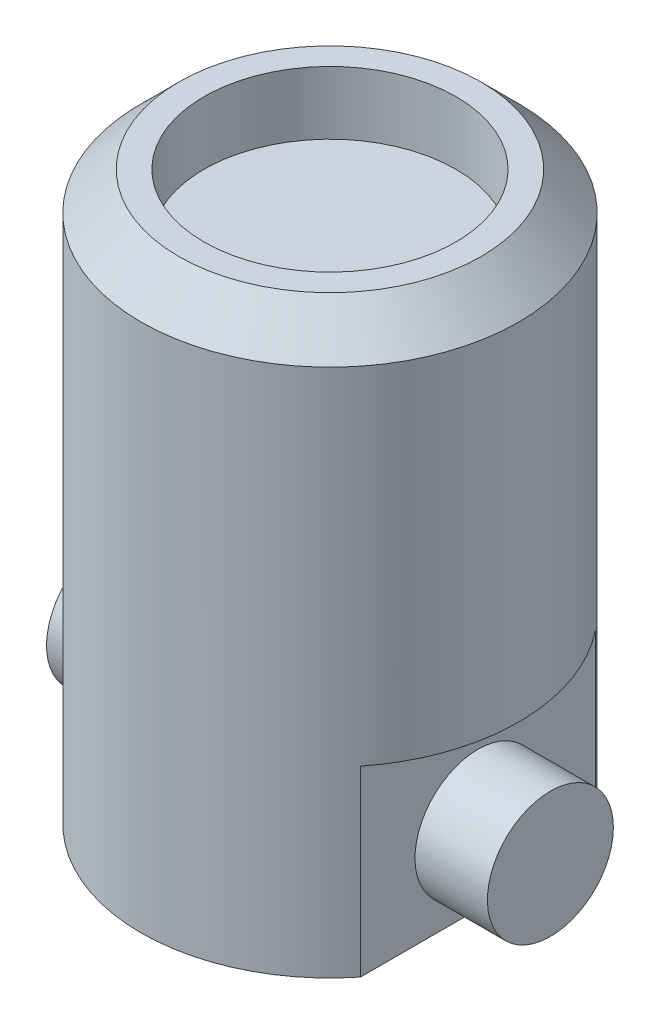
ISO-10303-21;
HEADER;
FILE_DESCRIPTION(('STEP AP214'),'2;1');
FILE_NAME('part.step','',(''),(''),'','','');
FILE_SCHEMA(('AUTOMOTIVE_DESIGN { 1 0 10303 214 1 1 1 1 }'));
ENDSEC;
DATA;
#1=APPLICATION_CONTEXT('core data for automotive mechanical design processes');
#2=APPLICATION_PROTOCOL_DEFINITION('international standard','automotive_design',2000,#1);
#3=PRODUCT_CONTEXT('',#1,'mechanical');
#4=PRODUCT('Part','Part','',(#3));
#5=PRODUCT_RELATED_PRODUCT_CATEGORY('part','',(#4));
#6=PRODUCT_DEFINITION_FORMATION('','',#4);
#7=PRODUCT_DEFINITION_CONTEXT('part definition',#1,'design');
#8=PRODUCT_DEFINITION('design','',#6,#7);
#9=PRODUCT_DEFINITION_SHAPE('','',#8);
#10=(LENGTH_UNIT() NAMED_UNIT(*) SI_UNIT(.MILLI.,.METRE.));
#11=(NAMED_UNIT(*) PLANE_ANGLE_UNIT() SI_UNIT($,.RADIAN.));
#12=(NAMED_UNIT(*) SI_UNIT($,.STERADIAN.) SOLID_ANGLE_UNIT());
#13=UNCERTAINTY_MEASURE_WITH_UNIT(LENGTH_MEASURE(1.E-05),#10,'distance_accuracy_value','');
#14=(GEOMETRIC_REPRESENTATION_CONTEXT(3) GLOBAL_UNCERTAINTY_ASSIGNED_CONTEXT((#13)) GLOBAL_UNIT_ASSIGNED_CONTEXT((#10,
#11,#12)) REPRESENTATION_CONTEXT('',''));
#15=CARTESIAN_POINT('',(0.,0.,0.));
#16=DIRECTION('',(0.,0.,1.));
#17=DIRECTION('',(1.,0.,0.));
#18=AXIS2_PLACEMENT_3D('',#15,#16,#17);
#19=CARTESIAN_POINT('',(-23.5,-37.4758211309043,-20.));
#20=DIRECTION('',(-1.,0.,0.));
#21=DIRECTION('',(0.,-1.,0.));
#22=AXIS2_PLACEMENT_3D('',#19,#20,#21);
#23=PLANE('',#22);
#24=DIRECTION('',(0.,-1.,0.));
#25=VECTOR('',#24,1.);
#26=CARTESIAN_POINT('',(-23.5,90.,-18.6480561989715));
#27=LINE('',#26,#25);
#28=CARTESIAN_POINT('',(-23.5,29.0000000000001,-18.6480561989715));
#29=VERTEX_POINT('',#28);
#30=CARTESIAN_POINT('',(-23.5,0.,-18.6480561989715));
#31=VERTEX_POINT('',#30);
#32=EDGE_CURVE('E120',#29,#31,#27,.T.);
#33=ORIENTED_EDGE('',*,*,#32,.T.);
#34=DIRECTION('',(0.,0.,1.));
#35=VECTOR('',#34,1.);
#36=CARTESIAN_POINT('',(-23.5,0.,0.));
#37=LINE('',#36,#35);
#38=CARTESIAN_POINT('',(-23.5,0.,18.6480561989715));
#39=VERTEX_POINT('',#38);
#40=EDGE_CURVE('E124',#31,#39,#37,.T.);
#41=ORIENTED_EDGE('',*,*,#40,.T.);
#42=DIRECTION('',(0.,-1.,0.));
#43=VECTOR('',#42,1.);
#44=CARTESIAN_POINT('',(-23.5,90.,18.6480561989715));
#45=LINE('',#44,#43);
#46=CARTESIAN_POINT('',(-23.5,29.0000000000001,18.6480561989715));
#47=VERTEX_POINT('',#46);
#48=EDGE_CURVE('E118',#39,#47,#45,.F.);
#49=ORIENTED_EDGE('',*,*,#48,.T.);
#50=DIRECTION('',(0.,0.,1.));
#51=VECTOR('',#50,1.);
#52=CARTESIAN_POINT('',(-23.5,29.0000000000001,-20.));
#53=LINE('',#52,#51);
#54=EDGE_CURVE('E115',#29,#47,#53,.T.);
#55=ORIENTED_EDGE('',*,*,#54,.F.);
#56=EDGE_LOOP('',(#33,#41,#49,#55));
#57=FACE_BOUND('',#56,.T.);
#58=CARTESIAN_POINT('',(-23.5,12.,0.));
#59=DIRECTION('',(-1.,0.,0.));
#60=DIRECTION('',(0.,-1.,0.));
#61=AXIS2_PLACEMENT_3D('',#58,#59,#60);
#62=CIRCLE('',#61,10.);
#63=CARTESIAN_POINT('',(-23.5,2.,0.));
#64=VERTEX_POINT('',#63);
#65=EDGE_CURVE('E86',#64,#64,#62,.F.);
#66=ORIENTED_EDGE('',*,*,#65,.T.);
#67=EDGE_LOOP('',(#66));
#68=FACE_BOUND('',#67,.T.);
#69=ADVANCED_FACE('F34',(#57,#68),#23,.T.);
#70=CARTESIAN_POINT('',(23.5,-37.4758211309043,-20.));
#71=DIRECTION('',(1.,0.,0.));
#72=DIRECTION('',(0.,1.,0.));
#73=AXIS2_PLACEMENT_3D('',#70,#71,#72);
#74=PLANE('',#73);
#75=DIRECTION('',(0.,-1.,0.));
#76=VECTOR('',#75,1.);
#77=CARTESIAN_POINT('',(23.5,90.,18.6480561989715));
#78=LINE('',#77,#76);
#79=CARTESIAN_POINT('',(23.5,29.0000000000001,18.6480561989715));
#80=VERTEX_POINT('',#79);
#81=CARTESIAN_POINT('',(23.5,0.,18.6480561989715));
#82=VERTEX_POINT('',#81);
#83=EDGE_CURVE('E49',#80,#82,#78,.T.);
#84=ORIENTED_EDGE('',*,*,#83,.T.);
#85=DIRECTION('',(0.,0.,-1.));
#86=VECTOR('',#85,1.);
#87=CARTESIAN_POINT('',(23.5,0.,0.));
#88=LINE('',#87,#86);
#89=CARTESIAN_POINT('',(23.5,0.,-18.6480561989715));
#90=VERTEX_POINT('',#89);
#91=EDGE_CURVE('E80',#82,#90,#88,.T.);
#92=ORIENTED_EDGE('',*,*,#91,.T.);
#93=DIRECTION('',(0.,-1.,0.));
#94=VECTOR('',#93,1.);
#95=CARTESIAN_POINT('',(23.5,90.,-18.6480561989715));
#96=LINE('',#95,#94);
#97=CARTESIAN_POINT('',(23.5,29.0000000000001,-18.6480561989715));
#98=VERTEX_POINT('',#97);
#99=EDGE_CURVE('E75',#90,#98,#96,.F.);
#100=ORIENTED_EDGE('',*,*,#99,.T.);
#101=DIRECTION('',(0.,0.,1.));
#102=VECTOR('',#101,1.);
#103=CARTESIAN_POINT('',(23.5,29.0000000000001,-20.));
#104=LINE('',#103,#102);
#105=EDGE_CURVE('E79',#98,#80,#104,.T.);
#106=ORIENTED_EDGE('',*,*,#105,.T.);
#107=EDGE_LOOP('',(#84,#92,#100,#106));
#108=FACE_BOUND('',#107,.T.);
#109=CARTESIAN_POINT('',(23.5,12.,0.));
#110=DIRECTION('',(1.,0.,0.));
#111=DIRECTION('',(0.,1.,0.));
#112=AXIS2_PLACEMENT_3D('',#109,#110,#111);
#113=CIRCLE('',#112,10.);
#114=CARTESIAN_POINT('',(23.5,22.,0.));
#115=VERTEX_POINT('',#114);
#116=EDGE_CURVE('E96',#115,#115,#113,.F.);
#117=ORIENTED_EDGE('',*,*,#116,.T.);
#118=EDGE_LOOP('',(#117));
#119=FACE_BOUND('',#118,.T.);
#120=ADVANCED_FACE('F77',(#108,#119),#74,.T.);
#121=CARTESIAN_POINT('',(0.,90.,0.));
#122=DIRECTION('',(0.,-1.,0.));
#123=DIRECTION('',(0.,0.,-1.));
#124=AXIS2_PLACEMENT_3D('',#121,#122,#123);
#125=CYLINDRICAL_SURFACE('',#124,30.);
#126=CARTESIAN_POINT('',(0.,84.,0.));
#127=DIRECTION('',(0.,1.,0.));
#128=DIRECTION('',(0.,0.,1.));
#129=AXIS2_PLACEMENT_3D('',#126,#127,#128);
#130=CIRCLE('',#129,30.);
#131=CARTESIAN_POINT('',(0.,84.,30.));
#132=VERTEX_POINT('',#131);
#133=EDGE_CURVE('E11',#132,#132,#130,.F.);
#134=ORIENTED_EDGE('',*,*,#133,.T.);
#135=EDGE_LOOP('',(#134));
#136=FACE_BOUND('',#135,.T.);
#137=ORIENTED_EDGE('',*,*,#83,.F.);
#138=CARTESIAN_POINT('',(0.,29.0000000000001,0.));
#139=DIRECTION('',(0.,-1.,0.));
#140=DIRECTION('',(1.,0.,0.));
#141=AXIS2_PLACEMENT_3D('',#138,#139,#140);
#142=CIRCLE('',#141,30.);
#143=EDGE_CURVE('E85',#98,#80,#142,.T.);
#144=ORIENTED_EDGE('',*,*,#143,.F.);
#145=ORIENTED_EDGE('',*,*,#99,.F.);
#146=CARTESIAN_POINT('',(0.,0.,0.));
#147=DIRECTION('',(0.,1.,0.));
#148=DIRECTION('',(0.,0.,1.));
#149=AXIS2_PLACEMENT_3D('',#146,#147,#148);
#150=CIRCLE('',#149,30.);
#151=EDGE_CURVE('E57',#90,#31,#150,.T.);
#152=ORIENTED_EDGE('',*,*,#151,.T.);
#153=ORIENTED_EDGE('',*,*,#32,.F.);
#154=CARTESIAN_POINT('',(0.,29.0000000000001,0.));
#155=DIRECTION('',(0.,-1.,0.));
#156=DIRECTION('',(0.,0.,-1.));
#157=AXIS2_PLACEMENT_3D('',#154,#155,#156);
#158=CIRCLE('',#157,30.);
#159=EDGE_CURVE('E92',#47,#29,#158,.T.);
#160=ORIENTED_EDGE('',*,*,#159,.F.);
#161=ORIENTED_EDGE('',*,*,#48,.F.);
#162=EDGE_CURVE('E122',#39,#82,#150,.T.);
#163=ORIENTED_EDGE('',*,*,#162,.T.);
#164=EDGE_LOOP('',(#137,#144,#145,#152,#153,#160,#161,#163));
#165=FACE_BOUND('',#164,.T.);
#166=ADVANCED_FACE('F88',(#136,#165),#125,.T.);
#167=CARTESIAN_POINT('',(0.,0.,0.));
#168=DIRECTION('',(0.,1.,0.));
#169=DIRECTION('',(0.,0.,1.));
#170=AXIS2_PLACEMENT_3D('',#167,#168,#169);
#171=PLANE('',#170);
#172=ORIENTED_EDGE('',*,*,#91,.F.);
#173=ORIENTED_EDGE('',*,*,#162,.F.);
#174=ORIENTED_EDGE('',*,*,#40,.F.);
#175=ORIENTED_EDGE('',*,*,#151,.F.);
#176=EDGE_LOOP('',(#172,#173,#174,#175));
#177=FACE_BOUND('',#176,.T.);
#178=ADVANCED_FACE('F135',(#177),#171,.F.);
#179=CARTESIAN_POINT('',(0.,90.,0.));
#180=DIRECTION('',(0.,1.,0.));
#181=DIRECTION('',(0.,0.,1.));
#182=AXIS2_PLACEMENT_3D('',#179,#180,#181);
#183=PLANE('',#182);
#184=CARTESIAN_POINT('',(0.,90.,0.));
#185=DIRECTION('',(0.,1.,0.));
#186=DIRECTION('',(0.,0.,1.));
#187=AXIS2_PLACEMENT_3D('',#184,#185,#186);
#188=CIRCLE('',#187,24.0000000000001);
#189=CARTESIAN_POINT('',(0.,90.,24.0000000000001));
#190=VERTEX_POINT('',#189);
#191=EDGE_CURVE('E42',#190,#190,#188,.T.);
#192=ORIENTED_EDGE('',*,*,#191,.T.);
#193=EDGE_LOOP('',(#192));
#194=FACE_BOUND('',#193,.T.);
#195=CARTESIAN_POINT('',(0.,90.,0.));
#196=DIRECTION('',(0.,1.,0.));
#197=DIRECTION('',(0.,0.,1.));
#198=AXIS2_PLACEMENT_3D('',#195,#196,#197);
#199=CIRCLE('',#198,20.);
#200=CARTESIAN_POINT('',(0.,90.,20.));
#201=VERTEX_POINT('',#200);
#202=EDGE_CURVE('E111',#201,#201,#199,.T.);
#203=ORIENTED_EDGE('',*,*,#202,.F.);
#204=EDGE_LOOP('',(#203));
#205=FACE_BOUND('',#204,.T.);
#206=ADVANCED_FACE('F137',(#194,#205),#183,.T.);
#207=CARTESIAN_POINT('',(0.,29.0000000000001,-20.));
#208=DIRECTION('',(0.,-1.,0.));
#209=DIRECTION('',(0.,0.,-1.));
#210=AXIS2_PLACEMENT_3D('',#207,#208,#209);
#211=PLANE('',#210);
#212=ORIENTED_EDGE('',*,*,#159,.T.);
#213=ORIENTED_EDGE('',*,*,#54,.T.);
#214=EDGE_LOOP('',(#212,#213));
#215=FACE_BOUND('',#214,.T.);
#216=ADVANCED_FACE('F128',(#215),#211,.T.);
#217=CARTESIAN_POINT('',(0.,29.0000000000001,-20.));
#218=DIRECTION('',(0.,-1.,0.));
#219=DIRECTION('',(1.,0.,0.));
#220=AXIS2_PLACEMENT_3D('',#217,#218,#219);
#221=PLANE('',#220);
#222=ORIENTED_EDGE('',*,*,#143,.T.);
#223=ORIENTED_EDGE('',*,*,#105,.F.);
#224=EDGE_LOOP('',(#222,#223));
#225=FACE_BOUND('',#224,.T.);
#226=ADVANCED_FACE('F84',(#225),#221,.T.);
#227=CARTESIAN_POINT('',(35.,12.,0.));
#228=DIRECTION('',(1.,0.,0.));
#229=DIRECTION('',(0.,0.,-1.));
#230=AXIS2_PLACEMENT_3D('',#227,#228,#229);
#231=PLANE('',#230);
#232=CARTESIAN_POINT('',(35.,12.,0.));
#233=DIRECTION('',(1.,0.,0.));
#234=DIRECTION('',(0.,0.,-1.));
#235=AXIS2_PLACEMENT_3D('',#232,#233,#234);
#236=CIRCLE('',#235,10.);
#237=CARTESIAN_POINT('',(35.,12.,-10.));
#238=VERTEX_POINT('',#237);
#239=EDGE_CURVE('E98',#238,#238,#236,.T.);
#240=ORIENTED_EDGE('',*,*,#239,.T.);
#241=EDGE_LOOP('',(#240));
#242=FACE_BOUND('',#241,.T.);
#243=ADVANCED_FACE('F156',(#242),#231,.T.);
#244=CARTESIAN_POINT('',(35.,12.,0.));
#245=DIRECTION('',(-1.,0.,0.));
#246=DIRECTION('',(0.,0.,1.));
#247=AXIS2_PLACEMENT_3D('',#244,#245,#246);
#248=CYLINDRICAL_SURFACE('',#247,10.);
#249=ORIENTED_EDGE('',*,*,#116,.F.);
#250=EDGE_LOOP('',(#249));
#251=FACE_BOUND('',#250,.T.);
#252=ORIENTED_EDGE('',*,*,#239,.F.);
#253=EDGE_LOOP('',(#252));
#254=FACE_BOUND('',#253,.T.);
#255=ADVANCED_FACE('F158',(#251,#254),#248,.T.);
#256=ORIENTED_EDGE('',*,*,#65,.F.);
#257=EDGE_LOOP('',(#256));
#258=FACE_BOUND('',#257,.T.);
#259=CARTESIAN_POINT('',(-35.,12.,0.));
#260=DIRECTION('',(1.,0.,0.));
#261=DIRECTION('',(0.,0.,-1.));
#262=AXIS2_PLACEMENT_3D('',#259,#260,#261);
#263=CIRCLE('',#262,10.);
#264=CARTESIAN_POINT('',(-35.,12.,-10.));
#265=VERTEX_POINT('',#264);
#266=EDGE_CURVE('E103',#265,#265,#263,.T.);
#267=ORIENTED_EDGE('',*,*,#266,.T.);
#268=EDGE_LOOP('',(#267));
#269=FACE_BOUND('',#268,.T.);
#270=ADVANCED_FACE('F161',(#258,#269),#248,.T.);
#271=CARTESIAN_POINT('',(-35.,12.,0.));
#272=DIRECTION('',(1.,0.,0.));
#273=DIRECTION('',(0.,0.,-1.));
#274=AXIS2_PLACEMENT_3D('',#271,#272,#273);
#275=PLANE('',#274);
#276=ORIENTED_EDGE('',*,*,#266,.F.);
#277=EDGE_LOOP('',(#276));
#278=FACE_BOUND('',#277,.T.);
#279=ADVANCED_FACE('F163',(#278),#275,.F.);
#280=CARTESIAN_POINT('',(0.,80.,0.));
#281=DIRECTION('',(0.,1.,0.));
#282=DIRECTION('',(0.,0.,1.));
#283=AXIS2_PLACEMENT_3D('',#280,#281,#282);
#284=CYLINDRICAL_SURFACE('',#283,20.);
#285=CARTESIAN_POINT('',(0.,80.,0.));
#286=DIRECTION('',(0.,1.,0.));
#287=DIRECTION('',(0.,0.,1.));
#288=AXIS2_PLACEMENT_3D('',#285,#286,#287);
#289=CIRCLE('',#288,20.);
#290=CARTESIAN_POINT('',(0.,80.,20.));
#291=VERTEX_POINT('',#290);
#292=EDGE_CURVE('E108',#291,#291,#289,.T.);
#293=ORIENTED_EDGE('',*,*,#292,.F.);
#294=EDGE_LOOP('',(#293));
#295=FACE_BOUND('',#294,.T.);
#296=ORIENTED_EDGE('',*,*,#202,.T.);
#297=EDGE_LOOP('',(#296));
#298=FACE_BOUND('',#297,.T.);
#299=ADVANCED_FACE('F166',(#295,#298),#284,.F.);
#300=CARTESIAN_POINT('',(0.,80.,0.));
#301=DIRECTION('',(0.,1.,0.));
#302=DIRECTION('',(0.,0.,1.));
#303=AXIS2_PLACEMENT_3D('',#300,#301,#302);
#304=PLANE('',#303);
#305=ORIENTED_EDGE('',*,*,#292,.T.);
#306=EDGE_LOOP('',(#305));
#307=FACE_BOUND('',#306,.T.);
#308=ADVANCED_FACE('F172',(#307),#304,.T.);
#309=CARTESIAN_POINT('',(0.,90.,0.));
#310=DIRECTION('',(0.,-1.,0.));
#311=DIRECTION('',(0.,0.,-1.));
#312=AXIS2_PLACEMENT_3D('',#309,#310,#311);
#313=CONICAL_SURFACE('',#312,24.0000000000001,0.785398163397444);
#314=ORIENTED_EDGE('',*,*,#133,.F.);
#315=EDGE_LOOP('',(#314));
#316=FACE_BOUND('',#315,.T.);
#317=ORIENTED_EDGE('',*,*,#191,.F.);
#318=EDGE_LOOP('',(#317));
#319=FACE_BOUND('',#318,.T.);
#320=ADVANCED_FACE('F36',(#316,#319),#313,.T.);
#321=CLOSED_SHELL('',(#69,#120,#166,#178,#206,#216,#226,#243,#255,#270,#279,#299,#308,#320));
#322=MANIFOLD_SOLID_BREP('B2',#321);
#323=ADVANCED_BREP_SHAPE_REPRESENTATION('',(#18,#322),#14);
#324=SHAPE_DEFINITION_REPRESENTATION(#9,#323);
ENDSEC;
END-ISO-10303-21;
